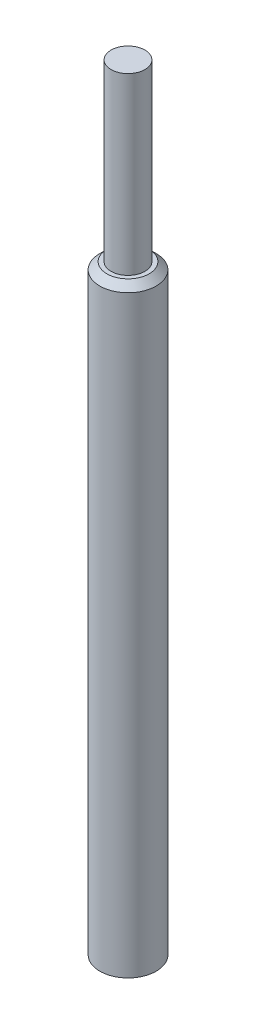
ISO-10303-21;
HEADER;
FILE_DESCRIPTION(('STEP AP214'),'2;1');
FILE_NAME('part.step','',(''),(''),'','','');
FILE_SCHEMA(('AUTOMOTIVE_DESIGN { 1 0 10303 214 1 1 1 1 }'));
ENDSEC;
DATA;
#1=APPLICATION_CONTEXT('core data for automotive mechanical design processes');
#2=APPLICATION_PROTOCOL_DEFINITION('international standard','automotive_design',2000,#1);
#3=PRODUCT_CONTEXT('',#1,'mechanical');
#4=PRODUCT('Part','Part','',(#3));
#5=PRODUCT_RELATED_PRODUCT_CATEGORY('part','',(#4));
#6=PRODUCT_DEFINITION_FORMATION('','',#4);
#7=PRODUCT_DEFINITION_CONTEXT('part definition',#1,'design');
#8=PRODUCT_DEFINITION('design','',#6,#7);
#9=PRODUCT_DEFINITION_SHAPE('','',#8);
#10=(LENGTH_UNIT() NAMED_UNIT(*) SI_UNIT(.MILLI.,.METRE.));
#11=(NAMED_UNIT(*) PLANE_ANGLE_UNIT() SI_UNIT($,.RADIAN.));
#12=(NAMED_UNIT(*) SI_UNIT($,.STERADIAN.) SOLID_ANGLE_UNIT());
#13=UNCERTAINTY_MEASURE_WITH_UNIT(LENGTH_MEASURE(1.E-05),#10,'distance_accuracy_value','');
#14=(GEOMETRIC_REPRESENTATION_CONTEXT(3) GLOBAL_UNCERTAINTY_ASSIGNED_CONTEXT((#13)) GLOBAL_UNIT_ASSIGNED_CONTEXT((#10,
#11,#12)) REPRESENTATION_CONTEXT('',''));
#15=CARTESIAN_POINT('',(0.,0.,0.));
#16=DIRECTION('',(0.,0.,1.));
#17=DIRECTION('',(1.,0.,0.));
#18=AXIS2_PLACEMENT_3D('',#15,#16,#17);
#19=CARTESIAN_POINT('',(0.,-79.5970106971715,0.));
#20=DIRECTION('',(0.,-1.,0.));
#21=DIRECTION('',(0.,0.,-1.));
#22=AXIS2_PLACEMENT_3D('',#19,#20,#21);
#23=PLANE('',#22);
#24=CARTESIAN_POINT('',(0.,-79.5970106971715,0.));
#25=DIRECTION('',(0.,-1.,0.));
#26=DIRECTION('',(0.,0.,-1.));
#27=AXIS2_PLACEMENT_3D('',#24,#25,#26);
#28=CIRCLE('',#27,10.);
#29=CARTESIAN_POINT('',(0.,-79.5970106971715,-10.));
#30=VERTEX_POINT('',#29);
#31=EDGE_CURVE('E41',#30,#30,#28,.T.);
#32=ORIENTED_EDGE('',*,*,#31,.T.);
#33=EDGE_LOOP('',(#32));
#34=FACE_BOUND('',#33,.T.);
#35=ADVANCED_FACE('F30',(#34),#23,.T.);
#36=CARTESIAN_POINT('',(0.,61.6790688952108,0.));
#37=DIRECTION('',(0.,-1.,0.));
#38=DIRECTION('',(0.,0.,-1.));
#39=AXIS2_PLACEMENT_3D('',#36,#37,#38);
#40=CYLINDRICAL_SURFACE('',#39,10.);
#41=CARTESIAN_POINT('',(0.,130.902989302828,0.));
#42=DIRECTION('',(0.,1.,0.));
#43=DIRECTION('',(0.,0.,1.));
#44=AXIS2_PLACEMENT_3D('',#41,#42,#43);
#45=CIRCLE('',#44,10.);
#46=CARTESIAN_POINT('',(0.,130.902989302828,10.));
#47=VERTEX_POINT('',#46);
#48=EDGE_CURVE('E37',#47,#47,#45,.F.);
#49=ORIENTED_EDGE('',*,*,#48,.T.);
#50=EDGE_LOOP('',(#49));
#51=FACE_BOUND('',#50,.T.);
#52=ORIENTED_EDGE('',*,*,#31,.F.);
#53=EDGE_LOOP('',(#52));
#54=FACE_BOUND('',#53,.T.);
#55=ADVANCED_FACE('F68',(#51,#54),#40,.T.);
#56=CARTESIAN_POINT('',(6.,133.402989302829,0.));
#57=DIRECTION('',(0.,1.,0.));
#58=DIRECTION('',(0.,0.,1.));
#59=AXIS2_PLACEMENT_3D('',#56,#57,#58);
#60=PLANE('',#59);
#61=CARTESIAN_POINT('',(0.,133.402989302829,0.));
#62=DIRECTION('',(0.,1.,0.));
#63=DIRECTION('',(0.,0.,1.));
#64=AXIS2_PLACEMENT_3D('',#61,#62,#63);
#65=CIRCLE('',#64,7.49999999999998);
#66=CARTESIAN_POINT('',(0.,133.402989302829,7.49999999999998));
#67=VERTEX_POINT('',#66);
#68=EDGE_CURVE('E10',#67,#67,#65,.T.);
#69=ORIENTED_EDGE('',*,*,#68,.T.);
#70=EDGE_LOOP('',(#69));
#71=FACE_BOUND('',#70,.T.);
#72=CARTESIAN_POINT('',(0.,133.402989302829,0.));
#73=DIRECTION('',(0.,-1.,0.));
#74=DIRECTION('',(0.,0.,-1.));
#75=AXIS2_PLACEMENT_3D('',#72,#73,#74);
#76=CIRCLE('',#75,6.);
#77=CARTESIAN_POINT('',(0.,133.402989302829,-6.));
#78=VERTEX_POINT('',#77);
#79=EDGE_CURVE('E45',#78,#78,#76,.T.);
#80=ORIENTED_EDGE('',*,*,#79,.T.);
#81=EDGE_LOOP('',(#80));
#82=FACE_BOUND('',#81,.T.);
#83=ADVANCED_FACE('F65',(#71,#82),#60,.T.);
#84=CARTESIAN_POINT('',(0.,61.6790688952108,0.));
#85=DIRECTION('',(0.,-1.,0.));
#86=DIRECTION('',(0.,0.,-1.));
#87=AXIS2_PLACEMENT_3D('',#84,#85,#86);
#88=CYLINDRICAL_SURFACE('',#87,6.);
#89=CARTESIAN_POINT('',(0.,195.402989302829,0.));
#90=DIRECTION('',(0.,-1.,0.));
#91=DIRECTION('',(0.,0.,-1.));
#92=AXIS2_PLACEMENT_3D('',#89,#90,#91);
#93=CIRCLE('',#92,6.);
#94=CARTESIAN_POINT('',(0.,195.402989302829,-6.));
#95=VERTEX_POINT('',#94);
#96=EDGE_CURVE('E50',#95,#95,#93,.T.);
#97=ORIENTED_EDGE('',*,*,#96,.T.);
#98=EDGE_LOOP('',(#97));
#99=FACE_BOUND('',#98,.T.);
#100=ORIENTED_EDGE('',*,*,#79,.F.);
#101=EDGE_LOOP('',(#100));
#102=FACE_BOUND('',#101,.T.);
#103=ADVANCED_FACE('F54',(#99,#102),#88,.T.);
#104=CARTESIAN_POINT('',(0.,195.402989302829,0.));
#105=DIRECTION('',(0.,1.,0.));
#106=DIRECTION('',(0.,0.,1.));
#107=AXIS2_PLACEMENT_3D('',#104,#105,#106);
#108=PLANE('',#107);
#109=ORIENTED_EDGE('',*,*,#96,.F.);
#110=EDGE_LOOP('',(#109));
#111=FACE_BOUND('',#110,.T.);
#112=ADVANCED_FACE('F57',(#111),#108,.T.);
#113=CARTESIAN_POINT('',(0.,130.902989302828,0.));
#114=DIRECTION('',(0.,-1.,0.));
#115=DIRECTION('',(0.,0.,-1.));
#116=AXIS2_PLACEMENT_3D('',#113,#114,#115);
#117=CONICAL_SURFACE('',#116,10.,0.785398163397447);
#118=ORIENTED_EDGE('',*,*,#68,.F.);
#119=EDGE_LOOP('',(#118));
#120=FACE_BOUND('',#119,.T.);
#121=ORIENTED_EDGE('',*,*,#48,.F.);
#122=EDGE_LOOP('',(#121));
#123=FACE_BOUND('',#122,.T.);
#124=ADVANCED_FACE('F32',(#120,#123),#117,.T.);
#125=CLOSED_SHELL('',(#35,#55,#83,#103,#112,#124));
#126=MANIFOLD_SOLID_BREP('B2',#125);
#127=ADVANCED_BREP_SHAPE_REPRESENTATION('',(#18,#126),#14);
#128=SHAPE_DEFINITION_REPRESENTATION(#9,#127);
ENDSEC;
END-ISO-10303-21;
